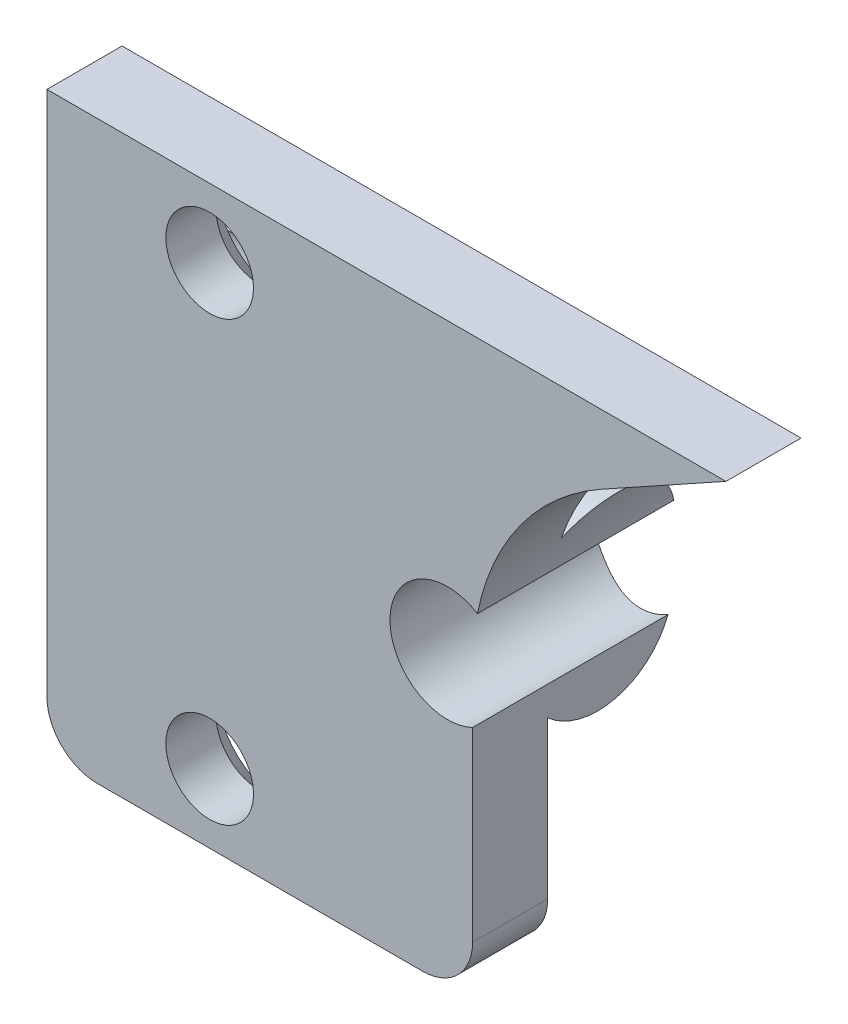
ISO-10303-21;
HEADER;
FILE_DESCRIPTION(('STEP AP214'),'2;1');
FILE_NAME('part.step','',(''),(''),'','','');
FILE_SCHEMA(('AUTOMOTIVE_DESIGN { 1 0 10303 214 1 1 1 1 }'));
ENDSEC;
DATA;
#1=APPLICATION_CONTEXT('core data for automotive mechanical design processes');
#2=APPLICATION_PROTOCOL_DEFINITION('international standard','automotive_design',2000,#1);
#3=PRODUCT_CONTEXT('',#1,'mechanical');
#4=PRODUCT('Part','Part','',(#3));
#5=PRODUCT_RELATED_PRODUCT_CATEGORY('part','',(#4));
#6=PRODUCT_DEFINITION_FORMATION('','',#4);
#7=PRODUCT_DEFINITION_CONTEXT('part definition',#1,'design');
#8=PRODUCT_DEFINITION('design','',#6,#7);
#9=PRODUCT_DEFINITION_SHAPE('','',#8);
#10=(LENGTH_UNIT() NAMED_UNIT(*) SI_UNIT(.MILLI.,.METRE.));
#11=(NAMED_UNIT(*) PLANE_ANGLE_UNIT() SI_UNIT($,.RADIAN.));
#12=(NAMED_UNIT(*) SI_UNIT($,.STERADIAN.) SOLID_ANGLE_UNIT());
#13=UNCERTAINTY_MEASURE_WITH_UNIT(LENGTH_MEASURE(1.E-05),#10,'distance_accuracy_value','');
#14=(GEOMETRIC_REPRESENTATION_CONTEXT(3) GLOBAL_UNCERTAINTY_ASSIGNED_CONTEXT((#13)) GLOBAL_UNIT_ASSIGNED_CONTEXT((#10,
#11,#12)) REPRESENTATION_CONTEXT('',''));
#15=CARTESIAN_POINT('',(0.,0.,0.));
#16=DIRECTION('',(0.,0.,1.));
#17=DIRECTION('',(1.,0.,0.));
#18=AXIS2_PLACEMENT_3D('',#15,#16,#17);
#19=CARTESIAN_POINT('',(0.,0.,2.));
#20=DIRECTION('',(0.,0.,-1.));
#21=DIRECTION('',(1.,0.,0.));
#22=AXIS2_PLACEMENT_3D('',#19,#20,#21);
#23=PLANE('',#22);
#24=DIRECTION('',(1.,0.,0.));
#25=VECTOR('',#24,1.);
#26=CARTESIAN_POINT('',(3.,-11.5,2.));
#27=LINE('',#26,#25);
#28=CARTESIAN_POINT('',(5.,-11.5,2.));
#29=VERTEX_POINT('',#28);
#30=CARTESIAN_POINT('',(9.5,-11.5,2.));
#31=VERTEX_POINT('',#30);
#32=EDGE_CURVE('E157',#29,#31,#27,.T.);
#33=ORIENTED_EDGE('',*,*,#32,.F.);
#34=CARTESIAN_POINT('',(5.,-9.5,2.));
#35=DIRECTION('',(0.,0.,1.));
#36=DIRECTION('',(1.,0.,0.));
#37=AXIS2_PLACEMENT_3D('',#34,#35,#36);
#38=CIRCLE('',#37,2.);
#39=CARTESIAN_POINT('',(3.,-9.5,2.));
#40=VERTEX_POINT('',#39);
#41=EDGE_CURVE('E378',#40,#29,#38,.T.);
#42=ORIENTED_EDGE('',*,*,#41,.F.);
#43=DIRECTION('',(0.,-1.,0.));
#44=VECTOR('',#43,1.);
#45=CARTESIAN_POINT('',(3.,11.5,2.));
#46=LINE('',#45,#44);
#47=CARTESIAN_POINT('',(3.,-3.23606797749979,2.));
#48=VERTEX_POINT('',#47);
#49=EDGE_CURVE('E149',#48,#40,#46,.T.);
#50=ORIENTED_EDGE('',*,*,#49,.F.);
#51=DIRECTION('',(-1.,0.,0.));
#52=VECTOR('',#51,1.);
#53=CARTESIAN_POINT('',(28.,-3.23606797749979,2.));
#54=LINE('',#53,#52);
#55=CARTESIAN_POINT('',(20.,-3.23606797749979,2.));
#56=VERTEX_POINT('',#55);
#57=EDGE_CURVE('E351',#56,#48,#54,.T.);
#58=ORIENTED_EDGE('',*,*,#57,.F.);
#59=DIRECTION('',(0.,-1.,0.));
#60=VECTOR('',#59,1.);
#61=CARTESIAN_POINT('',(20.,0.,2.));
#62=LINE('',#61,#60);
#63=CARTESIAN_POINT('',(20.,-9.5,2.));
#64=VERTEX_POINT('',#63);
#65=EDGE_CURVE('E333',#56,#64,#62,.T.);
#66=ORIENTED_EDGE('',*,*,#65,.T.);
#67=CARTESIAN_POINT('',(18.,-9.5,2.));
#68=DIRECTION('',(0.,0.,1.));
#69=DIRECTION('',(1.,0.,0.));
#70=AXIS2_PLACEMENT_3D('',#67,#68,#69);
#71=CIRCLE('',#70,2.);
#72=CARTESIAN_POINT('',(18.,-11.5,2.));
#73=VERTEX_POINT('',#72);
#74=EDGE_CURVE('E372',#73,#64,#71,.T.);
#75=ORIENTED_EDGE('',*,*,#74,.F.);
#76=EDGE_CURVE('E148',#31,#73,#27,.T.);
#77=ORIENTED_EDGE('',*,*,#76,.F.);
#78=CARTESIAN_POINT('',(9.5,-8.75,2.));
#79=DIRECTION('',(0.,0.,1.));
#80=DIRECTION('',(1.,0.,0.));
#81=AXIS2_PLACEMENT_3D('',#78,#79,#80);
#82=CIRCLE('',#81,2.75);
#83=EDGE_CURVE('E56',#31,#31,#82,.F.);
#84=ORIENTED_EDGE('',*,*,#83,.F.);
#85=EDGE_LOOP('',(#33,#42,#50,#58,#66,#75,#77,#84));
#86=FACE_BOUND('',#85,.T.);
#87=ADVANCED_FACE('F33',(#86),#23,.T.);
#88=CARTESIAN_POINT('',(25.1519037975366,8.74619707139393,-3.));
#89=DIRECTION('',(-0.484809620246341,0.874619707139394,0.));
#90=DIRECTION('',(-0.874619707139394,-0.484809620246341,0.));
#91=AXIS2_PLACEMENT_3D('',#88,#89,#90);
#92=PLANE('',#91);
#93=DIRECTION('',(0.874619707139394,0.484809620246341,0.));
#94=VECTOR('',#93,1.);
#95=CARTESIAN_POINT('',(25.1519037975366,8.74619707139393,2.));
#96=LINE('',#95,#94);
#97=CARTESIAN_POINT('',(25.1519037975366,8.74619707139393,2.));
#98=VERTEX_POINT('',#97);
#99=CARTESIAN_POINT('',(30.1198957893482,11.5,2.));
#100=VERTEX_POINT('',#99);
#101=EDGE_CURVE('E166',#98,#100,#96,.T.);
#102=ORIENTED_EDGE('',*,*,#101,.T.);
#103=DIRECTION('',(0.,0.,1.));
#104=VECTOR('',#103,1.);
#105=CARTESIAN_POINT('',(30.1198957893482,11.5,-3.));
#106=LINE('',#105,#104);
#107=CARTESIAN_POINT('',(30.1198957893482,11.5,5.));
#108=VERTEX_POINT('',#107);
#109=EDGE_CURVE('E171',#100,#108,#106,.T.);
#110=ORIENTED_EDGE('',*,*,#109,.T.);
#111=DIRECTION('',(-0.874619707139393,-0.484809620246341,0.));
#112=VECTOR('',#111,1.);
#113=CARTESIAN_POINT('',(40.5607565148914,17.2874636051264,5.));
#114=LINE('',#113,#112);
#115=CARTESIAN_POINT('',(25.1519037975366,8.74619707139393,5.));
#116=VERTEX_POINT('',#115);
#117=EDGE_CURVE('E314',#108,#116,#114,.T.);
#118=ORIENTED_EDGE('',*,*,#117,.T.);
#119=DIRECTION('',(0.,0.,1.));
#120=VECTOR('',#119,1.);
#121=CARTESIAN_POINT('',(25.1519037975366,8.74619707139393,-3.));
#122=LINE('',#121,#120);
#123=EDGE_CURVE('E337',#98,#116,#122,.T.);
#124=ORIENTED_EDGE('',*,*,#123,.F.);
#125=EDGE_LOOP('',(#102,#110,#118,#124));
#126=FACE_BOUND('',#125,.T.);
#127=ADVANCED_FACE('F214',(#126),#92,.F.);
#128=CARTESIAN_POINT('',(3.,11.5,2.));
#129=DIRECTION('',(0.,-1.,0.));
#130=DIRECTION('',(0.,0.,1.));
#131=AXIS2_PLACEMENT_3D('',#128,#129,#130);
#132=PLANE('',#131);
#133=DIRECTION('',(1.,0.,0.));
#134=VECTOR('',#133,1.);
#135=CARTESIAN_POINT('',(5.,11.5,5.));
#136=LINE('',#135,#134);
#137=CARTESIAN_POINT('',(3.,11.5,5.));
#138=VERTEX_POINT('',#137);
#139=EDGE_CURVE('E312',#138,#108,#136,.T.);
#140=ORIENTED_EDGE('',*,*,#139,.T.);
#141=ORIENTED_EDGE('',*,*,#109,.F.);
#142=DIRECTION('',(-1.,0.,0.));
#143=VECTOR('',#142,1.);
#144=CARTESIAN_POINT('',(3.,11.5,2.));
#145=LINE('',#144,#143);
#146=CARTESIAN_POINT('',(9.49999999999999,11.5,2.));
#147=VERTEX_POINT('',#146);
#148=EDGE_CURVE('E156',#100,#147,#145,.T.);
#149=ORIENTED_EDGE('',*,*,#148,.T.);
#150=CARTESIAN_POINT('',(3.,11.5,2.));
#151=VERTEX_POINT('',#150);
#152=EDGE_CURVE('E140',#147,#151,#145,.T.);
#153=ORIENTED_EDGE('',*,*,#152,.T.);
#154=DIRECTION('',(0.,0.,-1.));
#155=VECTOR('',#154,1.);
#156=CARTESIAN_POINT('',(3.,11.5,7.82842712474619));
#157=LINE('',#156,#155);
#158=EDGE_CURVE('E154',#138,#151,#157,.T.);
#159=ORIENTED_EDGE('',*,*,#158,.F.);
#160=EDGE_LOOP('',(#140,#141,#149,#153,#159));
#161=FACE_BOUND('',#160,.T.);
#162=ADVANCED_FACE('F153',(#161),#132,.F.);
#163=CARTESIAN_POINT('',(28.,1.,0.));
#164=DIRECTION('',(-1.,0.,0.));
#165=DIRECTION('',(0.,0.,-1.));
#166=AXIS2_PLACEMENT_3D('',#163,#164,#165);
#167=CYLINDRICAL_SURFACE('',#166,3.);
#168=DIRECTION('',(-1.,0.,0.));
#169=VECTOR('',#168,1.);
#170=CARTESIAN_POINT('',(28.,3.23606797749979,2.));
#171=LINE('',#170,#169);
#172=CARTESIAN_POINT('',(3.,3.23606797749979,2.));
#173=VERTEX_POINT('',#172);
#174=CARTESIAN_POINT('',(20.5380834898526,3.23606797749979,2.));
#175=VERTEX_POINT('',#174);
#176=EDGE_CURVE('E143',#173,#175,#171,.F.);
#177=ORIENTED_EDGE('',*,*,#176,.T.);
#178=CARTESIAN_POINT('',(20.5380834898526,3.23606797749979,2.));
#179=CARTESIAN_POINT('',(20.5567220895078,3.29056623012108,1.93906236706865));
#180=CARTESIAN_POINT('',(20.5750457105955,3.34260373031908,1.87587368654494));
#181=CARTESIAN_POINT('',(20.6106976508448,3.44147668944703,1.7452552183597));
#182=CARTESIAN_POINT('',(20.6280256577778,3.48831052073928,1.6778241139968));
#183=CARTESIAN_POINT('',(20.6780079508335,3.62068856182053,1.46937888348362));
#184=CARTESIAN_POINT('',(20.7085936575855,3.69791927869918,1.3224249217212));
#185=CARTESIAN_POINT('',(20.7612488497237,3.82758824896796,1.01611453841948));
#186=CARTESIAN_POINT('',(20.7832973966868,3.87996561648354,0.856728761140097));
#187=CARTESIAN_POINT('',(20.8162979902268,3.95745168490276,0.530556165574613));
#188=CARTESIAN_POINT('',(20.8272689233132,3.98260680299483,0.363782451801073));
#189=CARTESIAN_POINT('',(20.8365852652747,4.00399185582909,0.0371127374044125));
#190=CARTESIAN_POINT('',(20.8355799274623,4.00170917541649,-0.122668866633145));
#191=CARTESIAN_POINT('',(20.8226221022,3.97190024625738,-0.439461436785388));
#192=CARTESIAN_POINT('',(20.8106653156252,3.94436408394259,-0.59647129014165));
#193=CARTESIAN_POINT('',(20.7774830457337,3.86612384547195,-0.899604389070393));
#194=CARTESIAN_POINT('',(20.7564780661457,3.81596968294001,-1.04589533938463));
#195=CARTESIAN_POINT('',(20.7072359874637,3.69442999460934,-1.32802449827395));
#196=CARTESIAN_POINT('',(20.6789982987299,3.62304273772628,-1.46386185345494));
#197=CARTESIAN_POINT('',(20.6158194691714,3.45623568503165,-1.7300409922228));
#198=CARTESIAN_POINT('',(20.5805785482305,3.35963452645502,-1.85956908128228));
#199=CARTESIAN_POINT('',(20.5075249427662,3.14729796186204,-2.10118331395678));
#200=CARTESIAN_POINT('',(20.4697110511514,3.03155353797351,-2.21326118871162));
#201=CARTESIAN_POINT('',(20.4109396832364,2.83817211450461,-2.37260417471454));
#202=CARTESIAN_POINT('',(20.3898677923012,2.76610464435669,-2.42672639655807));
#203=CARTESIAN_POINT('',(20.3482699601418,2.61726444534258,-2.52835317921306));
#204=CARTESIAN_POINT('',(20.3277440490722,2.540491457359,-2.5758573751193));
#205=CARTESIAN_POINT('',(20.2876681248046,2.38269397407294,-2.66389328116988));
#206=CARTESIAN_POINT('',(20.2681191677912,2.30166506376973,-2.70441755633223));
#207=CARTESIAN_POINT('',(20.2304143117166,2.13599237774975,-2.77808426329281));
#208=CARTESIAN_POINT('',(20.2122586510434,2.05134798727644,-2.81122543370574));
#209=CARTESIAN_POINT('',(20.195,1.96519083042844,-2.84049408745325));
#210=B_SPLINE_CURVE_WITH_KNOTS('',3,(#178,#179,#180,#181,#182,#183,#184,#185,#186,#187,#188,
#189,#190,#191,#192,#193,#194,#195,#196,#197,#198,#199,#200,#201,#202,#203,#204,#205,#206,#207,
#208,#209),.UNSPECIFIED.,.F.,.F.,(4,2,2,2,2,2,2,2,2,2,2,2,2,2,2,4),(0.,0.251412693361009,
0.502903805162636,1.00675312738152,1.51183048995194,2.01604527166251,2.49305597780554,
2.97025402062343,3.43642798338315,3.90263996263409,4.3967163949123,4.89102623957051,
5.16839394125745,5.44577693041814,5.72345358363378,6.0011776409032),.UNSPECIFIED.);
#211=CARTESIAN_POINT('',(20.195,1.96519083042844,-2.84049408745325));
#212=VERTEX_POINT('',#211);
#213=EDGE_CURVE('E174',#175,#212,#210,.T.);
#214=ORIENTED_EDGE('',*,*,#213,.T.);
#215=CARTESIAN_POINT('',(16.9287684822792,1.,-3.));
#216=CARTESIAN_POINT('',(16.9557451902013,1.05589884184006,-3.00000830421828));
#217=CARTESIAN_POINT('',(16.9849915495914,1.11067336334779,-2.99843806512547));
#218=CARTESIAN_POINT('',(17.0477092702206,1.21753136170321,-2.99257868398128));
#219=CARTESIAN_POINT('',(17.0811767120521,1.26961727258272,-2.98829204951697));
#220=CARTESIAN_POINT('',(17.1519019269945,1.37051596633264,-2.9774626772858));
#221=CARTESIAN_POINT('',(17.189140618603,1.41934333888923,-2.97093093283844));
#222=CARTESIAN_POINT('',(17.2672441526867,1.51370816295,-2.95607631334087));
#223=CARTESIAN_POINT('',(17.3081097885407,1.55924489066771,-2.94775304583223));
#224=CARTESIAN_POINT('',(17.4354493782482,1.69025437028488,-2.92086758683389));
#225=CARTESIAN_POINT('',(17.5269535925054,1.77053432346075,-2.90033879662134));
#226=CARTESIAN_POINT('',(17.721318458883,1.9156552309591,-2.85785231387144));
#227=CARTESIAN_POINT('',(17.8241979531154,1.98046999053109,-2.8358922760653));
#228=CARTESIAN_POINT('',(18.0474204346871,2.09752856635184,-2.792779281421));
#229=CARTESIAN_POINT('',(18.1684949370885,2.14845997825829,-2.77181130128577));
#230=CARTESIAN_POINT('',(18.4184044442738,2.22911317541224,-2.73701305800485));
#231=CARTESIAN_POINT('',(18.5472298590892,2.25886060863601,-2.7231741691261));
#232=CARTESIAN_POINT('',(18.8025106980058,2.29495136863609,-2.70619452292101));
#233=CARTESIAN_POINT('',(18.9287832429099,2.30234919464129,-2.70257230413858));
#234=CARTESIAN_POINT('',(19.1807665183444,2.29634614723616,-2.70545714479396));
#235=CARTESIAN_POINT('',(19.3064770398099,2.2829380906825,-2.71196770253251));
#236=CARTESIAN_POINT('',(19.5447400716548,2.23762591573363,-2.73291654497485));
#237=CARTESIAN_POINT('',(19.6576039926574,2.2070519312842,-2.74678112721964));
#238=CARTESIAN_POINT('',(19.876620686165,2.12955442460096,-2.77954412291904));
#239=CARTESIAN_POINT('',(19.982782594938,2.08265375367347,-2.79843549207382));
#240=CARTESIAN_POINT('',(20.1220064136827,2.00821043191523,-2.82558965537743));
#241=CARTESIAN_POINT('',(20.158822482022,1.98719382998251,-2.83301505916803));
#242=CARTESIAN_POINT('',(20.195,1.96519083042845,-2.84049408745327));
#243=B_SPLINE_CURVE_WITH_KNOTS('',3,(#215,#216,#217,#218,#219,#220,#221,#222,#223,#224,#225,
#226,#227,#228,#229,#230,#231,#232,#233,#234,#235,#236,#237,#238,#239,#240,#241,#242),
.UNSPECIFIED.,.F.,.F.,(4,2,2,2,2,2,2,2,2,2,2,2,2,4),(0.,0.186094023873225,0.372016508458739,
0.557041283779496,0.742106632718569,1.11075049405047,1.48001439634576,1.87705586682551,
2.27361580813558,2.6511478157121,3.02881019362662,3.38059824548073,3.73189589113045,
3.8609354760349),.UNSPECIFIED.);
#244=CARTESIAN_POINT('',(16.9287684822792,1.,-3.));
#245=VERTEX_POINT('',#244);
#246=EDGE_CURVE('E11',#245,#212,#243,.T.);
#247=ORIENTED_EDGE('',*,*,#246,.F.);
#248=DIRECTION('',(-1.,0.,0.));
#249=VECTOR('',#248,1.);
#250=CARTESIAN_POINT('',(28.,0.999999999999999,-3.));
#251=LINE('',#250,#249);
#252=CARTESIAN_POINT('',(3.,0.999999999999999,-3.));
#253=VERTEX_POINT('',#252);
#254=EDGE_CURVE('E348',#245,#253,#251,.T.);
#255=ORIENTED_EDGE('',*,*,#254,.T.);
#256=CARTESIAN_POINT('',(3.,1.,0.));
#257=DIRECTION('',(-1.,0.,0.));
#258=DIRECTION('',(0.,0.,1.));
#259=AXIS2_PLACEMENT_3D('',#256,#257,#258);
#260=CIRCLE('',#259,3.);
#261=EDGE_CURVE('E339',#173,#253,#260,.T.);
#262=ORIENTED_EDGE('',*,*,#261,.F.);
#263=EDGE_LOOP('',(#177,#214,#247,#255,#262));
#264=FACE_BOUND('',#263,.T.);
#265=ADVANCED_FACE('F236',(#264),#167,.T.);
#266=ORIENTED_EDGE('',*,*,#148,.F.);
#267=ORIENTED_EDGE('',*,*,#101,.F.);
#268=CARTESIAN_POINT('',(30.,0.,2.));
#269=DIRECTION('',(0.,0.,1.));
#270=DIRECTION('',(1.,0.,0.));
#271=AXIS2_PLACEMENT_3D('',#268,#269,#270);
#272=CIRCLE('',#271,10.);
#273=EDGE_CURVE('E164',#98,#175,#272,.T.);
#274=ORIENTED_EDGE('',*,*,#273,.T.);
#275=ORIENTED_EDGE('',*,*,#176,.F.);
#276=EDGE_CURVE('E137',#151,#173,#46,.T.);
#277=ORIENTED_EDGE('',*,*,#276,.F.);
#278=ORIENTED_EDGE('',*,*,#152,.F.);
#279=CARTESIAN_POINT('',(9.49999999999999,8.75,2.));
#280=DIRECTION('',(0.,0.,1.));
#281=DIRECTION('',(1.,0.,0.));
#282=AXIS2_PLACEMENT_3D('',#279,#280,#281);
#283=CIRCLE('',#282,2.75);
#284=EDGE_CURVE('E47',#147,#147,#283,.F.);
#285=ORIENTED_EDGE('',*,*,#284,.F.);
#286=EDGE_LOOP('',(#266,#267,#274,#275,#277,#278,#285));
#287=FACE_BOUND('',#286,.T.);
#288=ADVANCED_FACE('F139',(#287),#23,.T.);
#289=CARTESIAN_POINT('',(30.,0.,2.));
#290=DIRECTION('',(0.,0.,1.));
#291=DIRECTION('',(-1.,0.,0.));
#292=AXIS2_PLACEMENT_3D('',#289,#290,#291);
#293=CYLINDRICAL_SURFACE('',#292,10.);
#294=ORIENTED_EDGE('',*,*,#213,.F.);
#295=ORIENTED_EDGE('',*,*,#273,.F.);
#296=ORIENTED_EDGE('',*,*,#123,.T.);
#297=CARTESIAN_POINT('',(30.,0.,5.));
#298=DIRECTION('',(0.,0.,1.));
#299=DIRECTION('',(-1.,0.,0.));
#300=AXIS2_PLACEMENT_3D('',#297,#298,#299);
#301=CIRCLE('',#300,10.);
#302=CARTESIAN_POINT('',(20.195,1.96519083042844,5.));
#303=VERTEX_POINT('',#302);
#304=EDGE_CURVE('E317',#116,#303,#301,.T.);
#305=ORIENTED_EDGE('',*,*,#304,.T.);
#306=DIRECTION('',(0.,0.,1.));
#307=VECTOR('',#306,1.);
#308=CARTESIAN_POINT('',(20.195,1.96519083042844,-3.));
#309=LINE('',#308,#307);
#310=EDGE_CURVE('E329',#212,#303,#309,.T.);
#311=ORIENTED_EDGE('',*,*,#310,.F.);
#312=EDGE_LOOP('',(#294,#295,#296,#305,#311));
#313=FACE_BOUND('',#312,.T.);
#314=ADVANCED_FACE('F183',(#313),#293,.F.);
#315=CARTESIAN_POINT('',(3.,11.5,2.));
#316=DIRECTION('',(1.,0.,0.));
#317=DIRECTION('',(0.,0.,1.));
#318=AXIS2_PLACEMENT_3D('',#315,#316,#317);
#319=PLANE('',#318);
#320=CARTESIAN_POINT('',(3.,0.,0.));
#321=DIRECTION('',(-1.,0.,0.));
#322=DIRECTION('',(0.,0.,1.));
#323=AXIS2_PLACEMENT_3D('',#320,#321,#322);
#324=CIRCLE('',#323,1.75);
#325=CARTESIAN_POINT('',(3.,0.,1.75));
#326=VERTEX_POINT('',#325);
#327=EDGE_CURVE('E320',#326,#326,#324,.T.);
#328=ORIENTED_EDGE('',*,*,#327,.F.);
#329=EDGE_LOOP('',(#328));
#330=FACE_BOUND('',#329,.T.);
#331=ORIENTED_EDGE('',*,*,#276,.T.);
#332=ORIENTED_EDGE('',*,*,#261,.T.);
#333=DIRECTION('',(0.,-1.,0.));
#334=VECTOR('',#333,1.);
#335=CARTESIAN_POINT('',(3.,0.999999999999999,-3.));
#336=LINE('',#335,#334);
#337=CARTESIAN_POINT('',(3.,-1.,-3.));
#338=VERTEX_POINT('',#337);
#339=EDGE_CURVE('E341',#253,#338,#336,.T.);
#340=ORIENTED_EDGE('',*,*,#339,.T.);
#341=CARTESIAN_POINT('',(3.,-1.,0.));
#342=DIRECTION('',(-1.,0.,0.));
#343=DIRECTION('',(0.,0.,1.));
#344=AXIS2_PLACEMENT_3D('',#341,#342,#343);
#345=CIRCLE('',#344,3.);
#346=EDGE_CURVE('E344',#338,#48,#345,.T.);
#347=ORIENTED_EDGE('',*,*,#346,.T.);
#348=ORIENTED_EDGE('',*,*,#49,.T.);
#349=DIRECTION('',(0.,0.,1.));
#350=VECTOR('',#349,1.);
#351=CARTESIAN_POINT('',(3.,-9.5,2.));
#352=LINE('',#351,#350);
#353=CARTESIAN_POINT('',(3.,-9.5,5.));
#354=VERTEX_POINT('',#353);
#355=EDGE_CURVE('E277',#354,#40,#352,.F.);
#356=ORIENTED_EDGE('',*,*,#355,.F.);
#357=DIRECTION('',(0.,1.,0.));
#358=VECTOR('',#357,1.);
#359=CARTESIAN_POINT('',(3.,-9.5,5.));
#360=LINE('',#359,#358);
#361=EDGE_CURVE('E162',#354,#138,#360,.T.);
#362=ORIENTED_EDGE('',*,*,#361,.T.);
#363=ORIENTED_EDGE('',*,*,#158,.T.);
#364=EDGE_LOOP('',(#331,#332,#340,#347,#348,#356,#362,#363));
#365=FACE_BOUND('',#364,.T.);
#366=ADVANCED_FACE('F159',(#330,#365),#319,.F.);
#367=CARTESIAN_POINT('',(3.,-11.5,2.));
#368=DIRECTION('',(0.,1.,0.));
#369=DIRECTION('',(0.,0.,-1.));
#370=AXIS2_PLACEMENT_3D('',#367,#368,#369);
#371=PLANE('',#370);
#372=DIRECTION('',(0.,0.,1.));
#373=VECTOR('',#372,1.);
#374=CARTESIAN_POINT('',(5.,-11.5,2.));
#375=LINE('',#374,#373);
#376=CARTESIAN_POINT('',(5.,-11.5,5.));
#377=VERTEX_POINT('',#376);
#378=EDGE_CURVE('E225',#29,#377,#375,.T.);
#379=ORIENTED_EDGE('',*,*,#378,.F.);
#380=ORIENTED_EDGE('',*,*,#32,.T.);
#381=ORIENTED_EDGE('',*,*,#76,.T.);
#382=DIRECTION('',(0.,0.,-1.));
#383=VECTOR('',#382,1.);
#384=CARTESIAN_POINT('',(18.,-11.5,2.));
#385=LINE('',#384,#383);
#386=CARTESIAN_POINT('',(18.,-11.5,5.));
#387=VERTEX_POINT('',#386);
#388=EDGE_CURVE('E375',#387,#73,#385,.T.);
#389=ORIENTED_EDGE('',*,*,#388,.F.);
#390=DIRECTION('',(-1.,0.,0.));
#391=VECTOR('',#390,1.);
#392=CARTESIAN_POINT('',(18.,-11.5,5.));
#393=LINE('',#392,#391);
#394=EDGE_CURVE('E306',#387,#377,#393,.T.);
#395=ORIENTED_EDGE('',*,*,#394,.T.);
#396=EDGE_LOOP('',(#379,#380,#381,#389,#395));
#397=FACE_BOUND('',#396,.T.);
#398=ADVANCED_FACE('F256',(#397),#371,.F.);
#399=CARTESIAN_POINT('',(9.49999999999999,8.75,2.));
#400=DIRECTION('',(0.,0.,1.));
#401=DIRECTION('',(-1.,0.,0.));
#402=AXIS2_PLACEMENT_3D('',#399,#400,#401);
#403=CYLINDRICAL_SURFACE('',#402,1.75);
#404=CARTESIAN_POINT('',(9.49999999999999,8.75,3.));
#405=DIRECTION('',(0.,0.,1.));
#406=DIRECTION('',(1.,0.,0.));
#407=AXIS2_PLACEMENT_3D('',#404,#405,#406);
#408=CIRCLE('',#407,1.75);
#409=CARTESIAN_POINT('',(11.25,8.75,3.));
#410=VERTEX_POINT('',#409);
#411=EDGE_CURVE('E279',#410,#410,#408,.T.);
#412=ORIENTED_EDGE('',*,*,#411,.F.);
#413=EDGE_LOOP('',(#412));
#414=FACE_BOUND('',#413,.T.);
#415=CARTESIAN_POINT('',(9.49999999999999,8.75,5.));
#416=DIRECTION('',(0.,0.,-1.));
#417=DIRECTION('',(-1.,0.,0.));
#418=AXIS2_PLACEMENT_3D('',#415,#416,#417);
#419=CIRCLE('',#418,1.75);
#420=CARTESIAN_POINT('',(7.74999999999999,8.75,5.));
#421=VERTEX_POINT('',#420);
#422=EDGE_CURVE('E181',#421,#421,#419,.T.);
#423=ORIENTED_EDGE('',*,*,#422,.F.);
#424=EDGE_LOOP('',(#423));
#425=FACE_BOUND('',#424,.T.);
#426=ADVANCED_FACE('F254',(#414,#425),#403,.F.);
#427=CARTESIAN_POINT('',(9.5,-8.75,2.));
#428=DIRECTION('',(0.,0.,1.));
#429=DIRECTION('',(-1.,0.,0.));
#430=AXIS2_PLACEMENT_3D('',#427,#428,#429);
#431=CYLINDRICAL_SURFACE('',#430,1.75);
#432=CARTESIAN_POINT('',(9.5,-8.75,3.));
#433=DIRECTION('',(0.,0.,1.));
#434=DIRECTION('',(1.,0.,0.));
#435=AXIS2_PLACEMENT_3D('',#432,#433,#434);
#436=CIRCLE('',#435,1.75);
#437=CARTESIAN_POINT('',(11.25,-8.75,3.));
#438=VERTEX_POINT('',#437);
#439=EDGE_CURVE('E275',#438,#438,#436,.T.);
#440=ORIENTED_EDGE('',*,*,#439,.F.);
#441=EDGE_LOOP('',(#440));
#442=FACE_BOUND('',#441,.T.);
#443=CARTESIAN_POINT('',(9.5,-8.75,5.));
#444=DIRECTION('',(0.,0.,-1.));
#445=DIRECTION('',(-1.,0.,0.));
#446=AXIS2_PLACEMENT_3D('',#443,#444,#445);
#447=CIRCLE('',#446,1.75);
#448=CARTESIAN_POINT('',(7.75,-8.75,5.));
#449=VERTEX_POINT('',#448);
#450=EDGE_CURVE('E294',#449,#449,#447,.T.);
#451=ORIENTED_EDGE('',*,*,#450,.F.);
#452=EDGE_LOOP('',(#451));
#453=FACE_BOUND('',#452,.T.);
#454=ADVANCED_FACE('F234',(#442,#453),#431,.F.);
#455=CARTESIAN_POINT('',(28.,0.999999999999999,-3.));
#456=DIRECTION('',(0.,0.,1.));
#457=DIRECTION('',(0.,1.,0.));
#458=AXIS2_PLACEMENT_3D('',#455,#456,#457);
#459=PLANE('',#458);
#460=ORIENTED_EDGE('',*,*,#254,.F.);
#461=CARTESIAN_POINT('',(19.,0.,-3.));
#462=DIRECTION('',(0.,0.,-1.));
#463=DIRECTION('',(-1.,0.,0.));
#464=AXIS2_PLACEMENT_3D('',#461,#462,#463);
#465=CIRCLE('',#464,2.3);
#466=CARTESIAN_POINT('',(16.9287684822792,-1.,-3.));
#467=VERTEX_POINT('',#466);
#468=EDGE_CURVE('E324',#467,#245,#465,.T.);
#469=ORIENTED_EDGE('',*,*,#468,.F.);
#470=DIRECTION('',(-1.,0.,0.));
#471=VECTOR('',#470,1.);
#472=CARTESIAN_POINT('',(28.,-1.,-3.));
#473=LINE('',#472,#471);
#474=EDGE_CURVE('E346',#467,#338,#473,.T.);
#475=ORIENTED_EDGE('',*,*,#474,.T.);
#476=ORIENTED_EDGE('',*,*,#339,.F.);
#477=EDGE_LOOP('',(#460,#469,#475,#476));
#478=FACE_BOUND('',#477,.T.);
#479=ADVANCED_FACE('F231',(#478),#459,.F.);
#480=CARTESIAN_POINT('',(28.,-1.,0.));
#481=DIRECTION('',(-1.,0.,0.));
#482=DIRECTION('',(0.,0.,-1.));
#483=AXIS2_PLACEMENT_3D('',#480,#481,#482);
#484=CYLINDRICAL_SURFACE('',#483,3.);
#485=CARTESIAN_POINT('',(20.,-1.,0.));
#486=DIRECTION('',(1.,0.,0.));
#487=DIRECTION('',(0.,-1.,0.));
#488=AXIS2_PLACEMENT_3D('',#485,#486,#487);
#489=CIRCLE('',#488,3.);
#490=CARTESIAN_POINT('',(20.,-2.0712315177208,-2.80222465827449));
#491=VERTEX_POINT('',#490);
#492=EDGE_CURVE('E226',#56,#491,#489,.T.);
#493=ORIENTED_EDGE('',*,*,#492,.F.);
#494=ORIENTED_EDGE('',*,*,#57,.T.);
#495=ORIENTED_EDGE('',*,*,#346,.F.);
#496=ORIENTED_EDGE('',*,*,#474,.F.);
#497=CARTESIAN_POINT('',(20.,-2.0712315177208,-2.80222465827449));
#498=CARTESIAN_POINT('',(19.9459567784959,-2.09732684655579,-2.7922431623547));
#499=CARTESIAN_POINT('',(19.8908237430107,-2.12133365293302,-2.78265342142491));
#500=CARTESIAN_POINT('',(19.7786545008995,-2.16502172105805,-2.76465034956416));
#501=CARTESIAN_POINT('',(19.7216174025947,-2.18470092249268,-2.7562375796633));
#502=CARTESIAN_POINT('',(19.6059391454382,-2.21956900683139,-2.74098773017002));
#503=CARTESIAN_POINT('',(19.5472971892583,-2.23475561178733,-2.7341514503148));
#504=CARTESIAN_POINT('',(19.4288410267889,-2.26048122076926,-2.72238528593673));
#505=CARTESIAN_POINT('',(19.3690270300705,-2.27102104790047,-2.71745506380414));
#506=CARTESIAN_POINT('',(19.188000260597,-2.29553226678774,-2.7059143624975));
#507=CARTESIAN_POINT('',(19.0654903973524,-2.30230838679264,-2.70259417975062));
#508=CARTESIAN_POINT('',(18.8212994130549,-2.29629829536762,-2.70547787428497));
#509=CARTESIAN_POINT('',(18.6996174042077,-2.28353817837101,-2.71166904734369));
#510=CARTESIAN_POINT('',(18.4652666953547,-2.24002281697712,-2.73182638250727));
#511=CARTESIAN_POINT('',(18.3524319345396,-2.21000167078298,-2.74547430211551));
#512=CARTESIAN_POINT('',(18.1331302026775,-2.13355424855168,-2.77790741781815));
#513=CARTESIAN_POINT('',(18.0266723200066,-2.08710518063379,-2.79669974296495));
#514=CARTESIAN_POINT('',(17.8143969496755,-1.97480280270074,-2.83788573767128));
#515=CARTESIAN_POINT('',(17.7092534933241,-1.90773543193479,-2.86044501913152));
#516=CARTESIAN_POINT('',(17.5110679555743,-1.75742311315344,-2.9038630082321));
#517=CARTESIAN_POINT('',(17.4180102616749,-1.67419939008238,-2.92472389660071));
#518=CARTESIAN_POINT('',(17.2509550930469,-1.4982229430184,-2.95961607844363));
#519=CARTESIAN_POINT('',(17.1761702917026,-1.40629109618787,-2.97397059171458));
#520=CARTESIAN_POINT('',(17.0749043190221,-1.25998240625116,-2.98911932694236));
#521=CARTESIAN_POINT('',(17.0429055443597,-1.20968339226703,-2.99310685814024));
#522=CARTESIAN_POINT('',(16.9828289610733,-1.106609720869,-2.99855056527616));
#523=CARTESIAN_POINT('',(16.9547545783358,-1.05383295346642,-3.00000454202797));
#524=CARTESIAN_POINT('',(16.9287684822792,-1.,-3.));
#525=B_SPLINE_CURVE_WITH_KNOTS('',3,(#497,#498,#499,#500,#501,#502,#503,#504,#505,#506,#507,
#508,#509,#510,#511,#512,#513,#514,#515,#516,#517,#518,#519,#520,#521,#522,#523,#524),
.UNSPECIFIED.,.F.,.F.,(4,2,2,2,2,2,2,2,2,2,2,2,2,4),(0.,0.182478880862046,0.365044450227092,
0.547702430491819,0.730328042692154,1.09647701879586,1.46213735842087,1.81328905155002,
2.16492985142645,2.54351316197169,2.92160244471142,3.27799514245934,3.45703134525153,
3.63622287850397),.UNSPECIFIED.);
#526=EDGE_CURVE('E218',#491,#467,#525,.T.);
#527=ORIENTED_EDGE('',*,*,#526,.F.);
#528=EDGE_LOOP('',(#493,#494,#495,#496,#527));
#529=FACE_BOUND('',#528,.T.);
#530=ADVANCED_FACE('F208',(#529),#484,.T.);
#531=CARTESIAN_POINT('',(20.,-2.0712315177208,-3.));
#532=DIRECTION('',(-1.,0.,0.));
#533=DIRECTION('',(0.,-1.,0.));
#534=AXIS2_PLACEMENT_3D('',#531,#532,#533);
#535=PLANE('',#534);
#536=ORIENTED_EDGE('',*,*,#65,.F.);
#537=ORIENTED_EDGE('',*,*,#492,.T.);
#538=DIRECTION('',(0.,0.,1.));
#539=VECTOR('',#538,1.);
#540=CARTESIAN_POINT('',(20.,-2.0712315177208,-3.));
#541=LINE('',#540,#539);
#542=CARTESIAN_POINT('',(20.,-2.0712315177208,5.));
#543=VERTEX_POINT('',#542);
#544=EDGE_CURVE('E330',#491,#543,#541,.T.);
#545=ORIENTED_EDGE('',*,*,#544,.T.);
#546=DIRECTION('',(0.,-1.,0.));
#547=VECTOR('',#546,1.);
#548=CARTESIAN_POINT('',(20.,-2.0712315177208,5.));
#549=LINE('',#548,#547);
#550=CARTESIAN_POINT('',(20.,-9.5,5.));
#551=VERTEX_POINT('',#550);
#552=EDGE_CURVE('E299',#543,#551,#549,.T.);
#553=ORIENTED_EDGE('',*,*,#552,.T.);
#554=DIRECTION('',(0.,0.,-1.));
#555=VECTOR('',#554,1.);
#556=CARTESIAN_POINT('',(20.,-9.5,-3.));
#557=LINE('',#556,#555);
#558=EDGE_CURVE('E281',#64,#551,#557,.F.);
#559=ORIENTED_EDGE('',*,*,#558,.F.);
#560=EDGE_LOOP('',(#536,#537,#545,#553,#559));
#561=FACE_BOUND('',#560,.T.);
#562=ADVANCED_FACE('F206',(#561),#535,.F.);
#563=CARTESIAN_POINT('',(19.,0.,-3.));
#564=DIRECTION('',(0.,0.,1.));
#565=DIRECTION('',(-1.,0.,0.));
#566=AXIS2_PLACEMENT_3D('',#563,#564,#565);
#567=CYLINDRICAL_SURFACE('',#566,2.3);
#568=ORIENTED_EDGE('',*,*,#468,.T.);
#569=ORIENTED_EDGE('',*,*,#246,.T.);
#570=ORIENTED_EDGE('',*,*,#310,.T.);
#571=CARTESIAN_POINT('',(19.,0.,5.));
#572=DIRECTION('',(0.,0.,1.));
#573=DIRECTION('',(-1.,0.,0.));
#574=AXIS2_PLACEMENT_3D('',#571,#572,#573);
#575=CIRCLE('',#574,2.3);
#576=EDGE_CURVE('E296',#303,#543,#575,.T.);
#577=ORIENTED_EDGE('',*,*,#576,.T.);
#578=ORIENTED_EDGE('',*,*,#544,.F.);
#579=ORIENTED_EDGE('',*,*,#526,.T.);
#580=EDGE_LOOP('',(#568,#569,#570,#577,#578,#579));
#581=FACE_BOUND('',#580,.T.);
#582=ADVANCED_FACE('F204',(#581),#567,.F.);
#583=CARTESIAN_POINT('',(15.,0.,0.));
#584=DIRECTION('',(-1.,0.,0.));
#585=DIRECTION('',(0.,0.,-1.));
#586=AXIS2_PLACEMENT_3D('',#583,#584,#585);
#587=CYLINDRICAL_SURFACE('',#586,1.75);
#588=CARTESIAN_POINT('',(15.,0.,0.));
#589=DIRECTION('',(-1.,0.,0.));
#590=DIRECTION('',(0.,0.,1.));
#591=AXIS2_PLACEMENT_3D('',#588,#589,#590);
#592=CIRCLE('',#591,1.75);
#593=CARTESIAN_POINT('',(15.,0.,1.75));
#594=VERTEX_POINT('',#593);
#595=EDGE_CURVE('E321',#594,#594,#592,.T.);
#596=ORIENTED_EDGE('',*,*,#595,.F.);
#597=EDGE_LOOP('',(#596));
#598=FACE_BOUND('',#597,.T.);
#599=ORIENTED_EDGE('',*,*,#327,.T.);
#600=EDGE_LOOP('',(#599));
#601=FACE_BOUND('',#600,.T.);
#602=ADVANCED_FACE('F200',(#598,#601),#587,.F.);
#603=CARTESIAN_POINT('',(15.,0.,0.));
#604=DIRECTION('',(1.,0.,0.));
#605=DIRECTION('',(0.,0.,1.));
#606=AXIS2_PLACEMENT_3D('',#603,#604,#605);
#607=PLANE('',#606);
#608=ORIENTED_EDGE('',*,*,#595,.T.);
#609=EDGE_LOOP('',(#608));
#610=FACE_BOUND('',#609,.T.);
#611=ADVANCED_FACE('F196',(#610),#607,.F.);
#612=CARTESIAN_POINT('',(18.,-9.5,2.));
#613=DIRECTION('',(0.,0.,-1.));
#614=DIRECTION('',(1.,0.,0.));
#615=AXIS2_PLACEMENT_3D('',#612,#613,#614);
#616=CYLINDRICAL_SURFACE('',#615,2.);
#617=ORIENTED_EDGE('',*,*,#388,.T.);
#618=ORIENTED_EDGE('',*,*,#74,.T.);
#619=ORIENTED_EDGE('',*,*,#558,.T.);
#620=CARTESIAN_POINT('',(18.,-9.5,5.));
#621=DIRECTION('',(0.,0.,-1.));
#622=DIRECTION('',(-1.,0.,0.));
#623=AXIS2_PLACEMENT_3D('',#620,#621,#622);
#624=CIRCLE('',#623,2.);
#625=EDGE_CURVE('E304',#551,#387,#624,.T.);
#626=ORIENTED_EDGE('',*,*,#625,.T.);
#627=EDGE_LOOP('',(#617,#618,#619,#626));
#628=FACE_BOUND('',#627,.T.);
#629=ADVANCED_FACE('F199',(#628),#616,.T.);
#630=CARTESIAN_POINT('',(5.,-9.5,2.));
#631=DIRECTION('',(0.,0.,1.));
#632=DIRECTION('',(-1.,0.,0.));
#633=AXIS2_PLACEMENT_3D('',#630,#631,#632);
#634=CYLINDRICAL_SURFACE('',#633,2.);
#635=ORIENTED_EDGE('',*,*,#41,.T.);
#636=ORIENTED_EDGE('',*,*,#378,.T.);
#637=CARTESIAN_POINT('',(5.,-9.5,5.));
#638=DIRECTION('',(0.,0.,-1.));
#639=DIRECTION('',(-1.,0.,0.));
#640=AXIS2_PLACEMENT_3D('',#637,#638,#639);
#641=CIRCLE('',#640,2.);
#642=EDGE_CURVE('E309',#377,#354,#641,.T.);
#643=ORIENTED_EDGE('',*,*,#642,.T.);
#644=ORIENTED_EDGE('',*,*,#355,.T.);
#645=EDGE_LOOP('',(#635,#636,#643,#644));
#646=FACE_BOUND('',#645,.T.);
#647=ADVANCED_FACE('F194',(#646),#634,.T.);
#648=CARTESIAN_POINT('',(19.,0.,5.));
#649=DIRECTION('',(0.,0.,1.));
#650=DIRECTION('',(-1.,0.,0.));
#651=AXIS2_PLACEMENT_3D('',#648,#649,#650);
#652=PLANE('',#651);
#653=ORIENTED_EDGE('',*,*,#117,.F.);
#654=ORIENTED_EDGE('',*,*,#139,.F.);
#655=ORIENTED_EDGE('',*,*,#361,.F.);
#656=ORIENTED_EDGE('',*,*,#642,.F.);
#657=ORIENTED_EDGE('',*,*,#394,.F.);
#658=ORIENTED_EDGE('',*,*,#625,.F.);
#659=ORIENTED_EDGE('',*,*,#552,.F.);
#660=ORIENTED_EDGE('',*,*,#576,.F.);
#661=ORIENTED_EDGE('',*,*,#304,.F.);
#662=EDGE_LOOP('',(#653,#654,#655,#656,#657,#658,#659,#660,#661));
#663=FACE_BOUND('',#662,.T.);
#664=ORIENTED_EDGE('',*,*,#450,.T.);
#665=EDGE_LOOP('',(#664));
#666=FACE_BOUND('',#665,.T.);
#667=ORIENTED_EDGE('',*,*,#422,.T.);
#668=EDGE_LOOP('',(#667));
#669=FACE_BOUND('',#668,.T.);
#670=ADVANCED_FACE('F189',(#663,#666,#669),#652,.T.);
#671=CARTESIAN_POINT('',(9.5,-8.75,3.));
#672=DIRECTION('',(0.,0.,-1.));
#673=DIRECTION('',(1.,0.,0.));
#674=AXIS2_PLACEMENT_3D('',#671,#672,#673);
#675=CONICAL_SURFACE('',#674,1.75,0.785398163397445);
#676=ORIENTED_EDGE('',*,*,#83,.T.);
#677=EDGE_LOOP('',(#676));
#678=FACE_BOUND('',#677,.T.);
#679=ORIENTED_EDGE('',*,*,#439,.T.);
#680=EDGE_LOOP('',(#679));
#681=FACE_BOUND('',#680,.T.);
#682=ADVANCED_FACE('F193',(#678,#681),#675,.F.);
#683=CARTESIAN_POINT('',(9.49999999999999,8.75,3.));
#684=DIRECTION('',(0.,0.,-1.));
#685=DIRECTION('',(1.,0.,0.));
#686=AXIS2_PLACEMENT_3D('',#683,#684,#685);
#687=CONICAL_SURFACE('',#686,1.75,0.785398163397445);
#688=ORIENTED_EDGE('',*,*,#284,.T.);
#689=EDGE_LOOP('',(#688));
#690=FACE_BOUND('',#689,.T.);
#691=ORIENTED_EDGE('',*,*,#411,.T.);
#692=EDGE_LOOP('',(#691));
#693=FACE_BOUND('',#692,.T.);
#694=ADVANCED_FACE('F35',(#690,#693),#687,.F.);
#695=CLOSED_SHELL('',(#87,#127,#162,#265,#288,#314,#366,#398,#426,#454,#479,#530,#562,#582,#602,
#611,#629,#647,#670,#682,#694));
#696=MANIFOLD_SOLID_BREP('B2',#695);
#697=ADVANCED_BREP_SHAPE_REPRESENTATION('',(#18,#696),#14);
#698=SHAPE_DEFINITION_REPRESENTATION(#9,#697);
ENDSEC;
END-ISO-10303-21;
